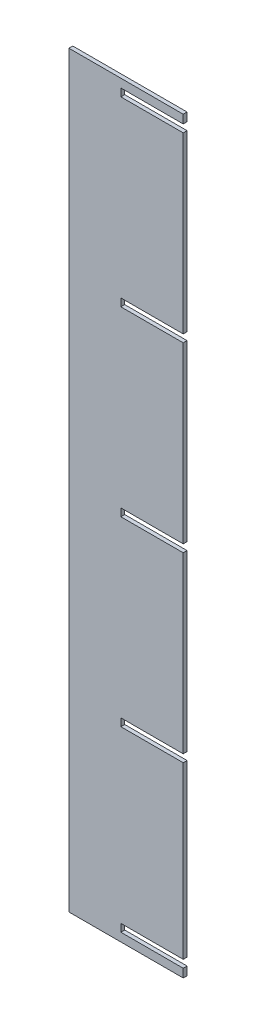
ISO-10303-21;
HEADER;
FILE_DESCRIPTION(('STEP AP214'),'2;1');
FILE_NAME('part.step','',(''),(''),'','','');
FILE_SCHEMA(('AUTOMOTIVE_DESIGN { 1 0 10303 214 1 1 1 1 }'));
ENDSEC;
DATA;
#1=APPLICATION_CONTEXT('core data for automotive mechanical design processes');
#2=APPLICATION_PROTOCOL_DEFINITION('international standard','automotive_design',2000,#1);
#3=PRODUCT_CONTEXT('',#1,'mechanical');
#4=PRODUCT('Part','Part','',(#3));
#5=PRODUCT_RELATED_PRODUCT_CATEGORY('part','',(#4));
#6=PRODUCT_DEFINITION_FORMATION('','',#4);
#7=PRODUCT_DEFINITION_CONTEXT('part definition',#1,'design');
#8=PRODUCT_DEFINITION('design','',#6,#7);
#9=PRODUCT_DEFINITION_SHAPE('','',#8);
#10=(LENGTH_UNIT() NAMED_UNIT(*) SI_UNIT(.MILLI.,.METRE.));
#11=(NAMED_UNIT(*) PLANE_ANGLE_UNIT() SI_UNIT($,.RADIAN.));
#12=(NAMED_UNIT(*) SI_UNIT($,.STERADIAN.) SOLID_ANGLE_UNIT());
#13=UNCERTAINTY_MEASURE_WITH_UNIT(LENGTH_MEASURE(1.E-05),#10,'distance_accuracy_value','');
#14=(GEOMETRIC_REPRESENTATION_CONTEXT(3) GLOBAL_UNCERTAINTY_ASSIGNED_CONTEXT((#13)) GLOBAL_UNIT_ASSIGNED_CONTEXT((#10,
#11,#12)) REPRESENTATION_CONTEXT('',''));
#15=CARTESIAN_POINT('',(0.,0.,0.));
#16=DIRECTION('',(0.,0.,1.));
#17=DIRECTION('',(1.,0.,0.));
#18=AXIS2_PLACEMENT_3D('',#15,#16,#17);
#19=CARTESIAN_POINT('',(26214.8619985443,0.,9.398));
#20=DIRECTION('',(1.,0.,0.));
#21=DIRECTION('',(0.,0.,-1.));
#22=AXIS2_PLACEMENT_3D('',#19,#20,#21);
#23=PLANE('',#22);
#24=DIRECTION('',(0.,-1.,0.));
#25=VECTOR('',#24,1.);
#26=CARTESIAN_POINT('',(26214.8619985443,0.,0.));
#27=LINE('',#26,#25);
#28=CARTESIAN_POINT('',(26214.8619985443,7474.55057188492,0.));
#29=VERTEX_POINT('',#28);
#30=CARTESIAN_POINT('',(26214.8619985443,7455.75457188492,0.));
#31=VERTEX_POINT('',#30);
#32=EDGE_CURVE('E228',#29,#31,#27,.T.);
#33=ORIENTED_EDGE('',*,*,#32,.F.);
#34=DIRECTION('',(0.,0.,-1.));
#35=VECTOR('',#34,1.);
#36=CARTESIAN_POINT('',(26214.8619985443,7474.55057188492,9.398));
#37=LINE('',#36,#35);
#38=CARTESIAN_POINT('',(26214.8619985443,7474.55057188492,9.398));
#39=VERTEX_POINT('',#38);
#40=EDGE_CURVE('E11',#39,#29,#37,.T.);
#41=ORIENTED_EDGE('',*,*,#40,.F.);
#42=DIRECTION('',(0.,-1.,0.));
#43=VECTOR('',#42,1.);
#44=CARTESIAN_POINT('',(26214.8619985443,0.,9.398));
#45=LINE('',#44,#43);
#46=CARTESIAN_POINT('',(26214.8619985443,7455.75457188492,9.398));
#47=VERTEX_POINT('',#46);
#48=EDGE_CURVE('E284',#39,#47,#45,.T.);
#49=ORIENTED_EDGE('',*,*,#48,.T.);
#50=DIRECTION('',(0.,0.,-1.));
#51=VECTOR('',#50,1.);
#52=CARTESIAN_POINT('',(26214.8619985443,7455.75457188492,9.398));
#53=LINE('',#52,#51);
#54=EDGE_CURVE('E51',#47,#31,#53,.T.);
#55=ORIENTED_EDGE('',*,*,#54,.T.);
#56=EDGE_LOOP('',(#33,#41,#49,#55));
#57=FACE_BOUND('',#56,.T.);
#58=ADVANCED_FACE('F35',(#57),#23,.T.);
#59=CARTESIAN_POINT('',(0.,7474.55057188492,9.398));
#60=DIRECTION('',(0.,-1.,0.));
#61=DIRECTION('',(0.,0.,-1.));
#62=AXIS2_PLACEMENT_3D('',#59,#60,#61);
#63=PLANE('',#62);
#64=DIRECTION('',(-1.,0.,0.));
#65=VECTOR('',#64,1.);
#66=CARTESIAN_POINT('',(0.,7474.55057188492,0.));
#67=LINE('',#66,#65);
#68=CARTESIAN_POINT('',(26367.2619985443,7474.55057188492,0.));
#69=VERTEX_POINT('',#68);
#70=EDGE_CURVE('E230',#69,#29,#67,.T.);
#71=ORIENTED_EDGE('',*,*,#70,.F.);
#72=DIRECTION('',(0.,0.,-1.));
#73=VECTOR('',#72,1.);
#74=CARTESIAN_POINT('',(26367.2619985443,7474.55057188492,9.398));
#75=LINE('',#74,#73);
#76=CARTESIAN_POINT('',(26367.2619985443,7474.55057188492,9.398));
#77=VERTEX_POINT('',#76);
#78=EDGE_CURVE('E43',#77,#69,#75,.T.);
#79=ORIENTED_EDGE('',*,*,#78,.F.);
#80=DIRECTION('',(-1.,0.,0.));
#81=VECTOR('',#80,1.);
#82=CARTESIAN_POINT('',(0.,7474.55057188492,9.398));
#83=LINE('',#82,#81);
#84=EDGE_CURVE('E340',#77,#39,#83,.T.);
#85=ORIENTED_EDGE('',*,*,#84,.T.);
#86=ORIENTED_EDGE('',*,*,#40,.T.);
#87=EDGE_LOOP('',(#71,#79,#85,#86));
#88=FACE_BOUND('',#87,.T.);
#89=ADVANCED_FACE('F339',(#88),#63,.T.);
#90=CARTESIAN_POINT('',(26367.2619985443,0.,9.398));
#91=DIRECTION('',(-1.,0.,0.));
#92=DIRECTION('',(0.,0.,1.));
#93=AXIS2_PLACEMENT_3D('',#90,#91,#92);
#94=PLANE('',#93);
#95=DIRECTION('',(0.,1.,0.));
#96=VECTOR('',#95,1.);
#97=CARTESIAN_POINT('',(26367.2619985443,0.,0.));
#98=LINE('',#97,#96);
#99=CARTESIAN_POINT('',(26367.2619985443,7900.25457188492,0.));
#100=VERTEX_POINT('',#99);
#101=EDGE_CURVE('E233',#69,#100,#98,.T.);
#102=ORIENTED_EDGE('',*,*,#101,.T.);
#103=DIRECTION('',(0.,0.,-1.));
#104=VECTOR('',#103,1.);
#105=CARTESIAN_POINT('',(26367.2619985443,7900.25457188492,9.398));
#106=LINE('',#105,#104);
#107=CARTESIAN_POINT('',(26367.2619985443,7900.25457188492,9.398));
#108=VERTEX_POINT('',#107);
#109=EDGE_CURVE('E326',#108,#100,#106,.T.);
#110=ORIENTED_EDGE('',*,*,#109,.F.);
#111=DIRECTION('',(0.,1.,0.));
#112=VECTOR('',#111,1.);
#113=CARTESIAN_POINT('',(26367.2619985443,0.,9.398));
#114=LINE('',#113,#112);
#115=EDGE_CURVE('E216',#77,#108,#114,.T.);
#116=ORIENTED_EDGE('',*,*,#115,.F.);
#117=ORIENTED_EDGE('',*,*,#78,.T.);
#118=EDGE_LOOP('',(#102,#110,#116,#117));
#119=FACE_BOUND('',#118,.T.);
#120=ADVANCED_FACE('F330',(#119),#94,.F.);
#121=CARTESIAN_POINT('',(0.,7900.25457188492,9.398));
#122=DIRECTION('',(0.,1.,0.));
#123=DIRECTION('',(0.,0.,1.));
#124=AXIS2_PLACEMENT_3D('',#121,#122,#123);
#125=PLANE('',#124);
#126=DIRECTION('',(1.,0.,0.));
#127=VECTOR('',#126,1.);
#128=CARTESIAN_POINT('',(0.,7900.25457188492,0.));
#129=LINE('',#128,#127);
#130=CARTESIAN_POINT('',(26214.8619985443,7900.25457188492,0.));
#131=VERTEX_POINT('',#130);
#132=EDGE_CURVE('E236',#131,#100,#129,.T.);
#133=ORIENTED_EDGE('',*,*,#132,.F.);
#134=DIRECTION('',(0.,0.,-1.));
#135=VECTOR('',#134,1.);
#136=CARTESIAN_POINT('',(26214.8619985443,7900.25457188492,9.398));
#137=LINE('',#136,#135);
#138=CARTESIAN_POINT('',(26214.8619985443,7900.25457188492,9.398));
#139=VERTEX_POINT('',#138);
#140=EDGE_CURVE('E324',#139,#131,#137,.T.);
#141=ORIENTED_EDGE('',*,*,#140,.F.);
#142=DIRECTION('',(1.,0.,0.));
#143=VECTOR('',#142,1.);
#144=CARTESIAN_POINT('',(0.,7900.25457188492,9.398));
#145=LINE('',#144,#143);
#146=EDGE_CURVE('E651',#139,#108,#145,.T.);
#147=ORIENTED_EDGE('',*,*,#146,.T.);
#148=ORIENTED_EDGE('',*,*,#109,.T.);
#149=EDGE_LOOP('',(#133,#141,#147,#148));
#150=FACE_BOUND('',#149,.T.);
#151=ADVANCED_FACE('F359',(#150),#125,.T.);
#152=CARTESIAN_POINT('',(26214.8619985443,0.,9.398));
#153=DIRECTION('',(1.,0.,0.));
#154=DIRECTION('',(0.,0.,-1.));
#155=AXIS2_PLACEMENT_3D('',#152,#153,#154);
#156=PLANE('',#155);
#157=DIRECTION('',(0.,-1.,0.));
#158=VECTOR('',#157,1.);
#159=CARTESIAN_POINT('',(26214.8619985443,0.,0.));
#160=LINE('',#159,#158);
#161=CARTESIAN_POINT('',(26214.8619985443,7919.05057188492,0.));
#162=VERTEX_POINT('',#161);
#163=EDGE_CURVE('E241',#162,#131,#160,.T.);
#164=ORIENTED_EDGE('',*,*,#163,.F.);
#165=DIRECTION('',(0.,0.,-1.));
#166=VECTOR('',#165,1.);
#167=CARTESIAN_POINT('',(26214.8619985443,7919.05057188492,9.398));
#168=LINE('',#167,#166);
#169=CARTESIAN_POINT('',(26214.8619985443,7919.05057188492,9.398));
#170=VERTEX_POINT('',#169);
#171=EDGE_CURVE('E322',#170,#162,#168,.T.);
#172=ORIENTED_EDGE('',*,*,#171,.F.);
#173=DIRECTION('',(0.,-1.,0.));
#174=VECTOR('',#173,1.);
#175=CARTESIAN_POINT('',(26214.8619985443,0.,9.398));
#176=LINE('',#175,#174);
#177=EDGE_CURVE('E654',#170,#139,#176,.T.);
#178=ORIENTED_EDGE('',*,*,#177,.T.);
#179=ORIENTED_EDGE('',*,*,#140,.T.);
#180=EDGE_LOOP('',(#164,#172,#178,#179));
#181=FACE_BOUND('',#180,.T.);
#182=ADVANCED_FACE('F364',(#181),#156,.T.);
#183=CARTESIAN_POINT('',(0.,7919.05057188492,9.398));
#184=DIRECTION('',(0.,-1.,0.));
#185=DIRECTION('',(0.,0.,-1.));
#186=AXIS2_PLACEMENT_3D('',#183,#184,#185);
#187=PLANE('',#186);
#188=DIRECTION('',(-1.,0.,0.));
#189=VECTOR('',#188,1.);
#190=CARTESIAN_POINT('',(0.,7919.05057188492,0.));
#191=LINE('',#190,#189);
#192=CARTESIAN_POINT('',(26367.2619985443,7919.05057188492,0.));
#193=VERTEX_POINT('',#192);
#194=EDGE_CURVE('E244',#193,#162,#191,.T.);
#195=ORIENTED_EDGE('',*,*,#194,.F.);
#196=DIRECTION('',(0.,0.,-1.));
#197=VECTOR('',#196,1.);
#198=CARTESIAN_POINT('',(26367.2619985443,7919.05057188492,9.398));
#199=LINE('',#198,#197);
#200=CARTESIAN_POINT('',(26367.2619985443,7919.05057188492,9.398));
#201=VERTEX_POINT('',#200);
#202=EDGE_CURVE('E320',#201,#193,#199,.T.);
#203=ORIENTED_EDGE('',*,*,#202,.F.);
#204=DIRECTION('',(-1.,0.,0.));
#205=VECTOR('',#204,1.);
#206=CARTESIAN_POINT('',(0.,7919.05057188492,9.398));
#207=LINE('',#206,#205);
#208=EDGE_CURVE('E596',#201,#170,#207,.T.);
#209=ORIENTED_EDGE('',*,*,#208,.T.);
#210=ORIENTED_EDGE('',*,*,#171,.T.);
#211=EDGE_LOOP('',(#195,#203,#209,#210));
#212=FACE_BOUND('',#211,.T.);
#213=ADVANCED_FACE('F368',(#212),#187,.T.);
#214=CARTESIAN_POINT('',(26367.2619985443,8344.75457188491,0.));
#215=VERTEX_POINT('',#214);
#216=EDGE_CURVE('E238',#193,#215,#98,.T.);
#217=ORIENTED_EDGE('',*,*,#216,.T.);
#218=DIRECTION('',(0.,0.,-1.));
#219=VECTOR('',#218,1.);
#220=CARTESIAN_POINT('',(26367.2619985443,8344.75457188491,9.398));
#221=LINE('',#220,#219);
#222=CARTESIAN_POINT('',(26367.2619985443,8344.75457188491,9.398));
#223=VERTEX_POINT('',#222);
#224=EDGE_CURVE('E318',#223,#215,#221,.T.);
#225=ORIENTED_EDGE('',*,*,#224,.F.);
#226=EDGE_CURVE('E592',#201,#223,#114,.T.);
#227=ORIENTED_EDGE('',*,*,#226,.F.);
#228=ORIENTED_EDGE('',*,*,#202,.T.);
#229=EDGE_LOOP('',(#217,#225,#227,#228));
#230=FACE_BOUND('',#229,.T.);
#231=ADVANCED_FACE('F360',(#230),#94,.F.);
#232=CARTESIAN_POINT('',(0.,8344.75457188491,9.398));
#233=DIRECTION('',(0.,1.,0.));
#234=DIRECTION('',(0.,0.,1.));
#235=AXIS2_PLACEMENT_3D('',#232,#233,#234);
#236=PLANE('',#235);
#237=DIRECTION('',(1.,0.,0.));
#238=VECTOR('',#237,1.);
#239=CARTESIAN_POINT('',(0.,8344.75457188491,0.));
#240=LINE('',#239,#238);
#241=CARTESIAN_POINT('',(26214.8619985443,8344.75457188491,0.));
#242=VERTEX_POINT('',#241);
#243=EDGE_CURVE('E247',#242,#215,#240,.T.);
#244=ORIENTED_EDGE('',*,*,#243,.F.);
#245=DIRECTION('',(0.,0.,-1.));
#246=VECTOR('',#245,1.);
#247=CARTESIAN_POINT('',(26214.8619985443,8344.75457188491,9.398));
#248=LINE('',#247,#246);
#249=CARTESIAN_POINT('',(26214.8619985443,8344.75457188491,9.398));
#250=VERTEX_POINT('',#249);
#251=EDGE_CURVE('E316',#250,#242,#248,.T.);
#252=ORIENTED_EDGE('',*,*,#251,.F.);
#253=DIRECTION('',(1.,0.,0.));
#254=VECTOR('',#253,1.);
#255=CARTESIAN_POINT('',(0.,8344.75457188491,9.398));
#256=LINE('',#255,#254);
#257=EDGE_CURVE('E588',#250,#223,#256,.T.);
#258=ORIENTED_EDGE('',*,*,#257,.T.);
#259=ORIENTED_EDGE('',*,*,#224,.T.);
#260=EDGE_LOOP('',(#244,#252,#258,#259));
#261=FACE_BOUND('',#260,.T.);
#262=ADVANCED_FACE('F373',(#261),#236,.T.);
#263=CARTESIAN_POINT('',(26214.8619985443,0.,9.398));
#264=DIRECTION('',(1.,0.,0.));
#265=DIRECTION('',(0.,0.,-1.));
#266=AXIS2_PLACEMENT_3D('',#263,#264,#265);
#267=PLANE('',#266);
#268=DIRECTION('',(0.,-1.,0.));
#269=VECTOR('',#268,1.);
#270=CARTESIAN_POINT('',(26214.8619985443,0.,0.));
#271=LINE('',#270,#269);
#272=CARTESIAN_POINT('',(26214.8619985443,8363.55057188492,0.));
#273=VERTEX_POINT('',#272);
#274=EDGE_CURVE('E250',#273,#242,#271,.T.);
#275=ORIENTED_EDGE('',*,*,#274,.F.);
#276=DIRECTION('',(0.,0.,-1.));
#277=VECTOR('',#276,1.);
#278=CARTESIAN_POINT('',(26214.8619985443,8363.55057188492,9.398));
#279=LINE('',#278,#277);
#280=CARTESIAN_POINT('',(26214.8619985443,8363.55057188492,9.398));
#281=VERTEX_POINT('',#280);
#282=EDGE_CURVE('E314',#281,#273,#279,.T.);
#283=ORIENTED_EDGE('',*,*,#282,.F.);
#284=DIRECTION('',(0.,-1.,0.));
#285=VECTOR('',#284,1.);
#286=CARTESIAN_POINT('',(26214.8619985443,0.,9.398));
#287=LINE('',#286,#285);
#288=EDGE_CURVE('E591',#281,#250,#287,.T.);
#289=ORIENTED_EDGE('',*,*,#288,.T.);
#290=ORIENTED_EDGE('',*,*,#251,.T.);
#291=EDGE_LOOP('',(#275,#283,#289,#290));
#292=FACE_BOUND('',#291,.T.);
#293=ADVANCED_FACE('F376',(#292),#267,.T.);
#294=CARTESIAN_POINT('',(0.,8363.55057188492,9.398));
#295=DIRECTION('',(0.,-1.,0.));
#296=DIRECTION('',(0.,0.,-1.));
#297=AXIS2_PLACEMENT_3D('',#294,#295,#296);
#298=PLANE('',#297);
#299=DIRECTION('',(-1.,0.,0.));
#300=VECTOR('',#299,1.);
#301=CARTESIAN_POINT('',(0.,8363.55057188492,0.));
#302=LINE('',#301,#300);
#303=CARTESIAN_POINT('',(26367.2619985443,8363.55057188492,0.));
#304=VERTEX_POINT('',#303);
#305=EDGE_CURVE('E253',#304,#273,#302,.T.);
#306=ORIENTED_EDGE('',*,*,#305,.F.);
#307=DIRECTION('',(0.,0.,-1.));
#308=VECTOR('',#307,1.);
#309=CARTESIAN_POINT('',(26367.2619985443,8363.55057188492,9.398));
#310=LINE('',#309,#308);
#311=CARTESIAN_POINT('',(26367.2619985443,8363.55057188492,9.398));
#312=VERTEX_POINT('',#311);
#313=EDGE_CURVE('E312',#312,#304,#310,.T.);
#314=ORIENTED_EDGE('',*,*,#313,.F.);
#315=DIRECTION('',(-1.,0.,0.));
#316=VECTOR('',#315,1.);
#317=CARTESIAN_POINT('',(0.,8363.55057188492,9.398));
#318=LINE('',#317,#316);
#319=EDGE_CURVE('E594',#312,#281,#318,.T.);
#320=ORIENTED_EDGE('',*,*,#319,.T.);
#321=ORIENTED_EDGE('',*,*,#282,.T.);
#322=EDGE_LOOP('',(#306,#314,#320,#321));
#323=FACE_BOUND('',#322,.T.);
#324=ADVANCED_FACE('F380',(#323),#298,.T.);
#325=CARTESIAN_POINT('',(26367.2619985443,8789.25457188492,0.));
#326=VERTEX_POINT('',#325);
#327=EDGE_CURVE('E256',#304,#326,#98,.T.);
#328=ORIENTED_EDGE('',*,*,#327,.T.);
#329=DIRECTION('',(0.,0.,-1.));
#330=VECTOR('',#329,1.);
#331=CARTESIAN_POINT('',(26367.2619985443,8789.25457188492,9.398));
#332=LINE('',#331,#330);
#333=CARTESIAN_POINT('',(26367.2619985443,8789.25457188492,9.398));
#334=VERTEX_POINT('',#333);
#335=EDGE_CURVE('E310',#334,#326,#332,.T.);
#336=ORIENTED_EDGE('',*,*,#335,.F.);
#337=EDGE_CURVE('E597',#312,#334,#114,.T.);
#338=ORIENTED_EDGE('',*,*,#337,.F.);
#339=ORIENTED_EDGE('',*,*,#313,.T.);
#340=EDGE_LOOP('',(#328,#336,#338,#339));
#341=FACE_BOUND('',#340,.T.);
#342=ADVANCED_FACE('F384',(#341),#94,.F.);
#343=CARTESIAN_POINT('',(0.,8789.25457188492,9.398));
#344=DIRECTION('',(0.,1.,0.));
#345=DIRECTION('',(0.,0.,1.));
#346=AXIS2_PLACEMENT_3D('',#343,#344,#345);
#347=PLANE('',#346);
#348=DIRECTION('',(1.,0.,0.));
#349=VECTOR('',#348,1.);
#350=CARTESIAN_POINT('',(0.,8789.25457188492,0.));
#351=LINE('',#350,#349);
#352=CARTESIAN_POINT('',(26214.8619985443,8789.25457188492,0.));
#353=VERTEX_POINT('',#352);
#354=EDGE_CURVE('E257',#353,#326,#351,.T.);
#355=ORIENTED_EDGE('',*,*,#354,.F.);
#356=DIRECTION('',(0.,0.,-1.));
#357=VECTOR('',#356,1.);
#358=CARTESIAN_POINT('',(26214.8619985443,8789.25457188492,9.398));
#359=LINE('',#358,#357);
#360=CARTESIAN_POINT('',(26214.8619985443,8789.25457188492,9.398));
#361=VERTEX_POINT('',#360);
#362=EDGE_CURVE('E308',#361,#353,#359,.T.);
#363=ORIENTED_EDGE('',*,*,#362,.F.);
#364=DIRECTION('',(1.,0.,0.));
#365=VECTOR('',#364,1.);
#366=CARTESIAN_POINT('',(0.,8789.25457188492,9.398));
#367=LINE('',#366,#365);
#368=EDGE_CURVE('E603',#361,#334,#367,.T.);
#369=ORIENTED_EDGE('',*,*,#368,.T.);
#370=ORIENTED_EDGE('',*,*,#335,.T.);
#371=EDGE_LOOP('',(#355,#363,#369,#370));
#372=FACE_BOUND('',#371,.T.);
#373=ADVANCED_FACE('F386',(#372),#347,.T.);
#374=CARTESIAN_POINT('',(26214.8619985443,0.,9.398));
#375=DIRECTION('',(1.,0.,0.));
#376=DIRECTION('',(0.,0.,-1.));
#377=AXIS2_PLACEMENT_3D('',#374,#375,#376);
#378=PLANE('',#377);
#379=DIRECTION('',(0.,-1.,0.));
#380=VECTOR('',#379,1.);
#381=CARTESIAN_POINT('',(26214.8619985443,0.,0.));
#382=LINE('',#381,#380);
#383=CARTESIAN_POINT('',(26214.8619985443,8808.05057188492,0.));
#384=VERTEX_POINT('',#383);
#385=EDGE_CURVE('E260',#384,#353,#382,.T.);
#386=ORIENTED_EDGE('',*,*,#385,.F.);
#387=DIRECTION('',(0.,0.,-1.));
#388=VECTOR('',#387,1.);
#389=CARTESIAN_POINT('',(26214.8619985443,8808.05057188492,9.398));
#390=LINE('',#389,#388);
#391=CARTESIAN_POINT('',(26214.8619985443,8808.05057188492,9.398));
#392=VERTEX_POINT('',#391);
#393=EDGE_CURVE('E306',#392,#384,#390,.T.);
#394=ORIENTED_EDGE('',*,*,#393,.F.);
#395=DIRECTION('',(0.,-1.,0.));
#396=VECTOR('',#395,1.);
#397=CARTESIAN_POINT('',(26214.8619985443,0.,9.398));
#398=LINE('',#397,#396);
#399=EDGE_CURVE('E606',#392,#361,#398,.T.);
#400=ORIENTED_EDGE('',*,*,#399,.T.);
#401=ORIENTED_EDGE('',*,*,#362,.T.);
#402=EDGE_LOOP('',(#386,#394,#400,#401));
#403=FACE_BOUND('',#402,.T.);
#404=ADVANCED_FACE('F389',(#403),#378,.T.);
#405=CARTESIAN_POINT('',(0.,8808.05057188492,9.398));
#406=DIRECTION('',(0.,-1.,0.));
#407=DIRECTION('',(0.,0.,-1.));
#408=AXIS2_PLACEMENT_3D('',#405,#406,#407);
#409=PLANE('',#408);
#410=DIRECTION('',(-1.,0.,0.));
#411=VECTOR('',#410,1.);
#412=CARTESIAN_POINT('',(0.,8808.05057188492,0.));
#413=LINE('',#412,#411);
#414=CARTESIAN_POINT('',(26367.2619985443,8808.05057188492,0.));
#415=VERTEX_POINT('',#414);
#416=EDGE_CURVE('E263',#415,#384,#413,.T.);
#417=ORIENTED_EDGE('',*,*,#416,.F.);
#418=DIRECTION('',(0.,0.,-1.));
#419=VECTOR('',#418,1.);
#420=CARTESIAN_POINT('',(26367.2619985443,8808.05057188492,9.398));
#421=LINE('',#420,#419);
#422=CARTESIAN_POINT('',(26367.2619985443,8808.05057188492,9.398));
#423=VERTEX_POINT('',#422);
#424=EDGE_CURVE('E304',#423,#415,#421,.T.);
#425=ORIENTED_EDGE('',*,*,#424,.F.);
#426=DIRECTION('',(-1.,0.,0.));
#427=VECTOR('',#426,1.);
#428=CARTESIAN_POINT('',(0.,8808.05057188492,9.398));
#429=LINE('',#428,#427);
#430=EDGE_CURVE('E609',#423,#392,#429,.T.);
#431=ORIENTED_EDGE('',*,*,#430,.T.);
#432=ORIENTED_EDGE('',*,*,#393,.T.);
#433=EDGE_LOOP('',(#417,#425,#431,#432));
#434=FACE_BOUND('',#433,.T.);
#435=ADVANCED_FACE('F393',(#434),#409,.T.);
#436=CARTESIAN_POINT('',(26367.2619985443,8828.75157188492,0.));
#437=VERTEX_POINT('',#436);
#438=EDGE_CURVE('E266',#415,#437,#98,.T.);
#439=ORIENTED_EDGE('',*,*,#438,.T.);
#440=DIRECTION('',(0.,0.,-1.));
#441=VECTOR('',#440,1.);
#442=CARTESIAN_POINT('',(26367.2619985443,8828.75157188492,9.398));
#443=LINE('',#442,#441);
#444=CARTESIAN_POINT('',(26367.2619985443,8828.75157188492,9.398));
#445=VERTEX_POINT('',#444);
#446=EDGE_CURVE('E301',#445,#437,#443,.T.);
#447=ORIENTED_EDGE('',*,*,#446,.F.);
#448=EDGE_CURVE('E612',#423,#445,#114,.T.);
#449=ORIENTED_EDGE('',*,*,#448,.F.);
#450=ORIENTED_EDGE('',*,*,#424,.T.);
#451=EDGE_LOOP('',(#439,#447,#449,#450));
#452=FACE_BOUND('',#451,.T.);
#453=ADVANCED_FACE('F397',(#452),#94,.F.);
#454=CARTESIAN_POINT('',(0.,8828.75157188492,9.398));
#455=DIRECTION('',(0.,-1.,0.));
#456=DIRECTION('',(0.,0.,-1.));
#457=AXIS2_PLACEMENT_3D('',#454,#455,#456);
#458=PLANE('',#457);
#459=DIRECTION('',(-1.,0.,0.));
#460=VECTOR('',#459,1.);
#461=CARTESIAN_POINT('',(0.,8828.75157188492,0.));
#462=LINE('',#461,#460);
#463=CARTESIAN_POINT('',(26087.8619985443,8828.75157188492,0.));
#464=VERTEX_POINT('',#463);
#465=EDGE_CURVE('E267',#437,#464,#462,.T.);
#466=ORIENTED_EDGE('',*,*,#465,.T.);
#467=DIRECTION('',(0.,0.,-1.));
#468=VECTOR('',#467,1.);
#469=CARTESIAN_POINT('',(26087.8619985443,8828.75157188492,9.398));
#470=LINE('',#469,#468);
#471=CARTESIAN_POINT('',(26087.8619985443,8828.75157188492,9.398));
#472=VERTEX_POINT('',#471);
#473=EDGE_CURVE('E298',#472,#464,#470,.T.);
#474=ORIENTED_EDGE('',*,*,#473,.F.);
#475=DIRECTION('',(-1.,0.,0.));
#476=VECTOR('',#475,1.);
#477=CARTESIAN_POINT('',(0.,8828.75157188492,9.398));
#478=LINE('',#477,#476);
#479=EDGE_CURVE('E613',#445,#472,#478,.T.);
#480=ORIENTED_EDGE('',*,*,#479,.F.);
#481=ORIENTED_EDGE('',*,*,#446,.T.);
#482=EDGE_LOOP('',(#466,#474,#480,#481));
#483=FACE_BOUND('',#482,.T.);
#484=ADVANCED_FACE('F399',(#483),#458,.F.);
#485=CARTESIAN_POINT('',(26087.8619985443,0.,9.398));
#486=DIRECTION('',(1.,0.,0.));
#487=DIRECTION('',(0.,0.,-1.));
#488=AXIS2_PLACEMENT_3D('',#485,#486,#487);
#489=PLANE('',#488);
#490=DIRECTION('',(0.,-1.,0.));
#491=VECTOR('',#490,1.);
#492=CARTESIAN_POINT('',(26087.8619985443,0.,0.));
#493=LINE('',#492,#491);
#494=CARTESIAN_POINT('',(26087.8619985443,6999.95157188492,0.));
#495=VERTEX_POINT('',#494);
#496=EDGE_CURVE('E269',#464,#495,#493,.T.);
#497=ORIENTED_EDGE('',*,*,#496,.T.);
#498=DIRECTION('',(0.,0.,-1.));
#499=VECTOR('',#498,1.);
#500=CARTESIAN_POINT('',(26087.8619985443,6999.95157188492,9.398));
#501=LINE('',#500,#499);
#502=CARTESIAN_POINT('',(26087.8619985443,6999.95157188492,9.398));
#503=VERTEX_POINT('',#502);
#504=EDGE_CURVE('E295',#503,#495,#501,.T.);
#505=ORIENTED_EDGE('',*,*,#504,.F.);
#506=DIRECTION('',(0.,-1.,0.));
#507=VECTOR('',#506,1.);
#508=CARTESIAN_POINT('',(26087.8619985443,0.,9.398));
#509=LINE('',#508,#507);
#510=EDGE_CURVE('E615',#472,#503,#509,.T.);
#511=ORIENTED_EDGE('',*,*,#510,.F.);
#512=ORIENTED_EDGE('',*,*,#473,.T.);
#513=EDGE_LOOP('',(#497,#505,#511,#512));
#514=FACE_BOUND('',#513,.T.);
#515=ADVANCED_FACE('F402',(#514),#489,.F.);
#516=CARTESIAN_POINT('',(0.,6999.95157188492,9.398));
#517=DIRECTION('',(0.,1.,0.));
#518=DIRECTION('',(0.,0.,1.));
#519=AXIS2_PLACEMENT_3D('',#516,#517,#518);
#520=PLANE('',#519);
#521=DIRECTION('',(1.,0.,0.));
#522=VECTOR('',#521,1.);
#523=CARTESIAN_POINT('',(0.,6999.95157188492,0.));
#524=LINE('',#523,#522);
#525=CARTESIAN_POINT('',(26367.2619985443,6999.95157188492,0.));
#526=VERTEX_POINT('',#525);
#527=EDGE_CURVE('E271',#495,#526,#524,.T.);
#528=ORIENTED_EDGE('',*,*,#527,.T.);
#529=DIRECTION('',(0.,0.,-1.));
#530=VECTOR('',#529,1.);
#531=CARTESIAN_POINT('',(26367.2619985443,6999.95157188492,9.398));
#532=LINE('',#531,#530);
#533=CARTESIAN_POINT('',(26367.2619985443,6999.95157188492,9.398));
#534=VERTEX_POINT('',#533);
#535=EDGE_CURVE('E292',#534,#526,#532,.T.);
#536=ORIENTED_EDGE('',*,*,#535,.F.);
#537=DIRECTION('',(1.,0.,0.));
#538=VECTOR('',#537,1.);
#539=CARTESIAN_POINT('',(0.,6999.95157188492,9.398));
#540=LINE('',#539,#538);
#541=EDGE_CURVE('E617',#503,#534,#540,.T.);
#542=ORIENTED_EDGE('',*,*,#541,.F.);
#543=ORIENTED_EDGE('',*,*,#504,.T.);
#544=EDGE_LOOP('',(#528,#536,#542,#543));
#545=FACE_BOUND('',#544,.T.);
#546=ADVANCED_FACE('F406',(#545),#520,.F.);
#547=CARTESIAN_POINT('',(26367.2619985443,7020.65257188492,0.));
#548=VERTEX_POINT('',#547);
#549=EDGE_CURVE('E273',#526,#548,#98,.T.);
#550=ORIENTED_EDGE('',*,*,#549,.T.);
#551=DIRECTION('',(0.,0.,-1.));
#552=VECTOR('',#551,1.);
#553=CARTESIAN_POINT('',(26367.2619985443,7020.65257188492,9.398));
#554=LINE('',#553,#552);
#555=CARTESIAN_POINT('',(26367.2619985443,7020.65257188492,9.398));
#556=VERTEX_POINT('',#555);
#557=EDGE_CURVE('E290',#556,#548,#554,.T.);
#558=ORIENTED_EDGE('',*,*,#557,.F.);
#559=EDGE_CURVE('E215',#534,#556,#114,.T.);
#560=ORIENTED_EDGE('',*,*,#559,.F.);
#561=ORIENTED_EDGE('',*,*,#535,.T.);
#562=EDGE_LOOP('',(#550,#558,#560,#561));
#563=FACE_BOUND('',#562,.T.);
#564=ADVANCED_FACE('F350',(#563),#94,.F.);
#565=CARTESIAN_POINT('',(0.,7020.65257188492,9.398));
#566=DIRECTION('',(0.,1.,0.));
#567=DIRECTION('',(0.,0.,1.));
#568=AXIS2_PLACEMENT_3D('',#565,#566,#567);
#569=PLANE('',#568);
#570=DIRECTION('',(1.,0.,0.));
#571=VECTOR('',#570,1.);
#572=CARTESIAN_POINT('',(0.,7020.65257188492,0.));
#573=LINE('',#572,#571);
#574=CARTESIAN_POINT('',(26214.8619985443,7020.65257188492,0.));
#575=VERTEX_POINT('',#574);
#576=EDGE_CURVE('E274',#575,#548,#573,.T.);
#577=ORIENTED_EDGE('',*,*,#576,.F.);
#578=DIRECTION('',(0.,0.,-1.));
#579=VECTOR('',#578,1.);
#580=CARTESIAN_POINT('',(26214.8619985443,7020.65257188492,9.398));
#581=LINE('',#580,#579);
#582=CARTESIAN_POINT('',(26214.8619985443,7020.65257188492,9.398));
#583=VERTEX_POINT('',#582);
#584=EDGE_CURVE('E288',#583,#575,#581,.T.);
#585=ORIENTED_EDGE('',*,*,#584,.F.);
#586=DIRECTION('',(1.,0.,0.));
#587=VECTOR('',#586,1.);
#588=CARTESIAN_POINT('',(0.,7020.65257188492,9.398));
#589=LINE('',#588,#587);
#590=EDGE_CURVE('E223',#583,#556,#589,.T.);
#591=ORIENTED_EDGE('',*,*,#590,.T.);
#592=ORIENTED_EDGE('',*,*,#557,.T.);
#593=EDGE_LOOP('',(#577,#585,#591,#592));
#594=FACE_BOUND('',#593,.T.);
#595=ADVANCED_FACE('F411',(#594),#569,.T.);
#596=CARTESIAN_POINT('',(26214.8619985443,0.,9.398));
#597=DIRECTION('',(1.,0.,0.));
#598=DIRECTION('',(0.,0.,-1.));
#599=AXIS2_PLACEMENT_3D('',#596,#597,#598);
#600=PLANE('',#599);
#601=DIRECTION('',(0.,-1.,0.));
#602=VECTOR('',#601,1.);
#603=CARTESIAN_POINT('',(26214.8619985443,0.,0.));
#604=LINE('',#603,#602);
#605=CARTESIAN_POINT('',(26214.8619985443,7039.44857188492,0.));
#606=VERTEX_POINT('',#605);
#607=EDGE_CURVE('E277',#606,#575,#604,.T.);
#608=ORIENTED_EDGE('',*,*,#607,.F.);
#609=DIRECTION('',(0.,0.,-1.));
#610=VECTOR('',#609,1.);
#611=CARTESIAN_POINT('',(26214.8619985443,7039.44857188492,9.398));
#612=LINE('',#611,#610);
#613=CARTESIAN_POINT('',(26214.8619985443,7039.44857188492,9.398));
#614=VERTEX_POINT('',#613);
#615=EDGE_CURVE('E207',#614,#606,#612,.T.);
#616=ORIENTED_EDGE('',*,*,#615,.F.);
#617=DIRECTION('',(0.,-1.,0.));
#618=VECTOR('',#617,1.);
#619=CARTESIAN_POINT('',(26214.8619985443,0.,9.398));
#620=LINE('',#619,#618);
#621=EDGE_CURVE('E221',#614,#583,#620,.T.);
#622=ORIENTED_EDGE('',*,*,#621,.T.);
#623=ORIENTED_EDGE('',*,*,#584,.T.);
#624=EDGE_LOOP('',(#608,#616,#622,#623));
#625=FACE_BOUND('',#624,.T.);
#626=ADVANCED_FACE('F414',(#625),#600,.T.);
#627=CARTESIAN_POINT('',(0.,7039.44857188492,9.398));
#628=DIRECTION('',(0.,-1.,0.));
#629=DIRECTION('',(0.,0.,-1.));
#630=AXIS2_PLACEMENT_3D('',#627,#628,#629);
#631=PLANE('',#630);
#632=DIRECTION('',(-1.,0.,0.));
#633=VECTOR('',#632,1.);
#634=CARTESIAN_POINT('',(0.,7039.44857188492,0.));
#635=LINE('',#634,#633);
#636=CARTESIAN_POINT('',(26367.2619985443,7039.44857188492,0.));
#637=VERTEX_POINT('',#636);
#638=EDGE_CURVE('E204',#637,#606,#635,.T.);
#639=ORIENTED_EDGE('',*,*,#638,.F.);
#640=DIRECTION('',(0.,0.,-1.));
#641=VECTOR('',#640,1.);
#642=CARTESIAN_POINT('',(26367.2619985443,7039.44857188492,9.398));
#643=LINE('',#642,#641);
#644=CARTESIAN_POINT('',(26367.2619985443,7039.44857188492,9.398));
#645=VERTEX_POINT('',#644);
#646=EDGE_CURVE('E198',#645,#637,#643,.T.);
#647=ORIENTED_EDGE('',*,*,#646,.F.);
#648=DIRECTION('',(-1.,0.,0.));
#649=VECTOR('',#648,1.);
#650=CARTESIAN_POINT('',(0.,7039.44857188492,9.398));
#651=LINE('',#650,#649);
#652=EDGE_CURVE('E202',#645,#614,#651,.T.);
#653=ORIENTED_EDGE('',*,*,#652,.T.);
#654=ORIENTED_EDGE('',*,*,#615,.T.);
#655=EDGE_LOOP('',(#639,#647,#653,#654));
#656=FACE_BOUND('',#655,.T.);
#657=ADVANCED_FACE('F200',(#656),#631,.T.);
#658=CARTESIAN_POINT('',(26367.2619985443,7455.75457188492,0.));
#659=VERTEX_POINT('',#658);
#660=EDGE_CURVE('E237',#637,#659,#98,.T.);
#661=ORIENTED_EDGE('',*,*,#660,.T.);
#662=DIRECTION('',(0.,0.,-1.));
#663=VECTOR('',#662,1.);
#664=CARTESIAN_POINT('',(26367.2619985443,7455.75457188492,9.398));
#665=LINE('',#664,#663);
#666=CARTESIAN_POINT('',(26367.2619985443,7455.75457188492,9.398));
#667=VERTEX_POINT('',#666);
#668=EDGE_CURVE('E125',#667,#659,#665,.T.);
#669=ORIENTED_EDGE('',*,*,#668,.F.);
#670=EDGE_CURVE('E209',#645,#667,#114,.T.);
#671=ORIENTED_EDGE('',*,*,#670,.F.);
#672=ORIENTED_EDGE('',*,*,#646,.T.);
#673=EDGE_LOOP('',(#661,#669,#671,#672));
#674=FACE_BOUND('',#673,.T.);
#675=ADVANCED_FACE('F210',(#674),#94,.F.);
#676=CARTESIAN_POINT('',(0.,7455.75457188492,9.398));
#677=DIRECTION('',(0.,1.,0.));
#678=DIRECTION('',(0.,0.,1.));
#679=AXIS2_PLACEMENT_3D('',#676,#677,#678);
#680=PLANE('',#679);
#681=DIRECTION('',(1.,0.,0.));
#682=VECTOR('',#681,1.);
#683=CARTESIAN_POINT('',(0.,7455.75457188492,0.));
#684=LINE('',#683,#682);
#685=EDGE_CURVE('E281',#31,#659,#684,.T.);
#686=ORIENTED_EDGE('',*,*,#685,.F.);
#687=ORIENTED_EDGE('',*,*,#54,.F.);
#688=DIRECTION('',(1.,0.,0.));
#689=VECTOR('',#688,1.);
#690=CARTESIAN_POINT('',(0.,7455.75457188492,9.398));
#691=LINE('',#690,#689);
#692=EDGE_CURVE('E213',#47,#667,#691,.T.);
#693=ORIENTED_EDGE('',*,*,#692,.T.);
#694=ORIENTED_EDGE('',*,*,#668,.T.);
#695=EDGE_LOOP('',(#686,#687,#693,#694));
#696=FACE_BOUND('',#695,.T.);
#697=ADVANCED_FACE('F341',(#696),#680,.T.);
#698=CARTESIAN_POINT('',(0.,0.,9.398));
#699=DIRECTION('',(0.,0.,1.));
#700=DIRECTION('',(1.,0.,0.));
#701=AXIS2_PLACEMENT_3D('',#698,#699,#700);
#702=PLANE('',#701);
#703=ORIENTED_EDGE('',*,*,#48,.F.);
#704=ORIENTED_EDGE('',*,*,#84,.F.);
#705=ORIENTED_EDGE('',*,*,#115,.T.);
#706=ORIENTED_EDGE('',*,*,#146,.F.);
#707=ORIENTED_EDGE('',*,*,#177,.F.);
#708=ORIENTED_EDGE('',*,*,#208,.F.);
#709=ORIENTED_EDGE('',*,*,#226,.T.);
#710=ORIENTED_EDGE('',*,*,#257,.F.);
#711=ORIENTED_EDGE('',*,*,#288,.F.);
#712=ORIENTED_EDGE('',*,*,#319,.F.);
#713=ORIENTED_EDGE('',*,*,#337,.T.);
#714=ORIENTED_EDGE('',*,*,#368,.F.);
#715=ORIENTED_EDGE('',*,*,#399,.F.);
#716=ORIENTED_EDGE('',*,*,#430,.F.);
#717=ORIENTED_EDGE('',*,*,#448,.T.);
#718=ORIENTED_EDGE('',*,*,#479,.T.);
#719=ORIENTED_EDGE('',*,*,#510,.T.);
#720=ORIENTED_EDGE('',*,*,#541,.T.);
#721=ORIENTED_EDGE('',*,*,#559,.T.);
#722=ORIENTED_EDGE('',*,*,#590,.F.);
#723=ORIENTED_EDGE('',*,*,#621,.F.);
#724=ORIENTED_EDGE('',*,*,#652,.F.);
#725=ORIENTED_EDGE('',*,*,#670,.T.);
#726=ORIENTED_EDGE('',*,*,#692,.F.);
#727=EDGE_LOOP('',(#703,#704,#705,#706,#707,#708,#709,#710,#711,#712,#713,#714,#715,#716,#717,
#718,#719,#720,#721,#722,#723,#724,#725,#726));
#728=FACE_BOUND('',#727,.T.);
#729=ADVANCED_FACE('F218',(#728),#702,.T.);
#730=CARTESIAN_POINT('',(0.,0.,0.));
#731=DIRECTION('',(0.,0.,1.));
#732=DIRECTION('',(1.,0.,0.));
#733=AXIS2_PLACEMENT_3D('',#730,#731,#732);
#734=PLANE('',#733);
#735=ORIENTED_EDGE('',*,*,#32,.T.);
#736=ORIENTED_EDGE('',*,*,#685,.T.);
#737=ORIENTED_EDGE('',*,*,#660,.F.);
#738=ORIENTED_EDGE('',*,*,#638,.T.);
#739=ORIENTED_EDGE('',*,*,#607,.T.);
#740=ORIENTED_EDGE('',*,*,#576,.T.);
#741=ORIENTED_EDGE('',*,*,#549,.F.);
#742=ORIENTED_EDGE('',*,*,#527,.F.);
#743=ORIENTED_EDGE('',*,*,#496,.F.);
#744=ORIENTED_EDGE('',*,*,#465,.F.);
#745=ORIENTED_EDGE('',*,*,#438,.F.);
#746=ORIENTED_EDGE('',*,*,#416,.T.);
#747=ORIENTED_EDGE('',*,*,#385,.T.);
#748=ORIENTED_EDGE('',*,*,#354,.T.);
#749=ORIENTED_EDGE('',*,*,#327,.F.);
#750=ORIENTED_EDGE('',*,*,#305,.T.);
#751=ORIENTED_EDGE('',*,*,#274,.T.);
#752=ORIENTED_EDGE('',*,*,#243,.T.);
#753=ORIENTED_EDGE('',*,*,#216,.F.);
#754=ORIENTED_EDGE('',*,*,#194,.T.);
#755=ORIENTED_EDGE('',*,*,#163,.T.);
#756=ORIENTED_EDGE('',*,*,#132,.T.);
#757=ORIENTED_EDGE('',*,*,#101,.F.);
#758=ORIENTED_EDGE('',*,*,#70,.T.);
#759=EDGE_LOOP('',(#735,#736,#737,#738,#739,#740,#741,#742,#743,#744,#745,#746,#747,#748,#749,
#750,#751,#752,#753,#754,#755,#756,#757,#758));
#760=FACE_BOUND('',#759,.T.);
#761=ADVANCED_FACE('F337',(#760),#734,.F.);
#762=CLOSED_SHELL('',(#58,#89,#120,#151,#182,#213,#231,#262,#293,#324,#342,#373,#404,#435,#453,
#484,#515,#546,#564,#595,#626,#657,#675,#697,#729,#761));
#763=MANIFOLD_SOLID_BREP('B2',#762);
#764=ADVANCED_BREP_SHAPE_REPRESENTATION('',(#18,#763),#14);
#765=SHAPE_DEFINITION_REPRESENTATION(#9,#764);
ENDSEC;
END-ISO-10303-21;
